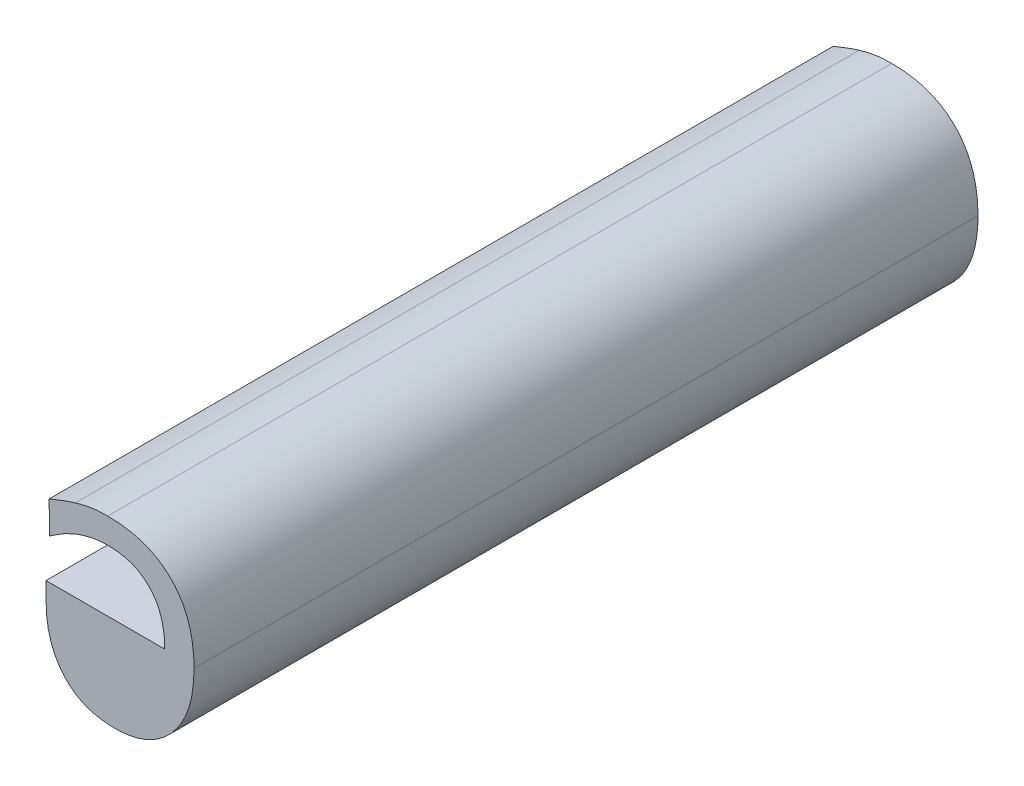
ISO-10303-21;
HEADER;
FILE_DESCRIPTION(('STEP AP214'),'2;1');
FILE_NAME('part.step','',(''),(''),'','','');
FILE_SCHEMA(('AUTOMOTIVE_DESIGN { 1 0 10303 214 1 1 1 1 }'));
ENDSEC;
DATA;
#1=APPLICATION_CONTEXT('core data for automotive mechanical design processes');
#2=APPLICATION_PROTOCOL_DEFINITION('international standard','automotive_design',2000,#1);
#3=PRODUCT_CONTEXT('',#1,'mechanical');
#4=PRODUCT('Part','Part','',(#3));
#5=PRODUCT_RELATED_PRODUCT_CATEGORY('part','',(#4));
#6=PRODUCT_DEFINITION_FORMATION('','',#4);
#7=PRODUCT_DEFINITION_CONTEXT('part definition',#1,'design');
#8=PRODUCT_DEFINITION('design','',#6,#7);
#9=PRODUCT_DEFINITION_SHAPE('','',#8);
#10=(LENGTH_UNIT() NAMED_UNIT(*) SI_UNIT(.MILLI.,.METRE.));
#11=(NAMED_UNIT(*) PLANE_ANGLE_UNIT() SI_UNIT($,.RADIAN.));
#12=(NAMED_UNIT(*) SI_UNIT($,.STERADIAN.) SOLID_ANGLE_UNIT());
#13=UNCERTAINTY_MEASURE_WITH_UNIT(LENGTH_MEASURE(1.E-05),#10,'distance_accuracy_value','');
#14=(GEOMETRIC_REPRESENTATION_CONTEXT(3) GLOBAL_UNCERTAINTY_ASSIGNED_CONTEXT((#13)) GLOBAL_UNIT_ASSIGNED_CONTEXT((#10,
#11,#12)) REPRESENTATION_CONTEXT('',''));
#15=CARTESIAN_POINT('',(0.,0.,0.));
#16=DIRECTION('',(0.,0.,1.));
#17=DIRECTION('',(1.,0.,0.));
#18=AXIS2_PLACEMENT_3D('',#15,#16,#17);
#19=CARTESIAN_POINT('',(5.08471298388066,3.56975577851379,0.));
#20=CARTESIAN_POINT('',(5.08471298388066,3.56975577851379,0.1));
#21=CARTESIAN_POINT('',(5.08486596612033,3.5698846056629,0.));
#22=CARTESIAN_POINT('',(5.08486596612033,3.5698846056629,0.1));
#23=CARTESIAN_POINT('',(5.08501894836,3.570013432812,0.));
#24=CARTESIAN_POINT('',(5.08501894836,3.570013432812,0.1));
#25=CARTESIAN_POINT('',(5.085467927339,3.570391520373,0.));
#26=CARTESIAN_POINT('',(5.085467927339,3.570391520373,0.1));
#27=CARTESIAN_POINT('',(5.086838494749,3.571218586914,0.));
#28=CARTESIAN_POINT('',(5.086838494749,3.571218586914,0.1));
#29=CARTESIAN_POINT('',(5.087830974598,3.571691196366,0.));
#30=CARTESIAN_POINT('',(5.087830974598,3.571691196366,0.1));
#31=B_SPLINE_SURFACE_WITH_KNOTS('',2,1,((#19,#20),(#21,#22),(#23,#24),(#25,#26),(#27,#28),(#29,
#30)),.UNSPECIFIED.,.F.,.F.,.F.,(3,2,1,3),(2,2),(-2.34073363525477,-2.,-1.,0.),(0.,0.01),.UNSPECIFIED.);
#32=CARTESIAN_POINT('',(5.08489451496393,3.56990864679433,0.1));
#33=CARTESIAN_POINT('',(5.08522839351065,3.57018056055757,0.1));
#34=CARTESIAN_POINT('',(5.08557407060745,3.5704337847817,0.1));
#35=CARTESIAN_POINT('',(5.0865314603025,3.57106191453689,0.1));
#36=CARTESIAN_POINT('',(5.08716460308373,3.57140287350332,0.1));
#37=CARTESIAN_POINT('',(5.087830974598,3.571691196366,0.1));
#38=B_SPLINE_CURVE_WITH_KNOTS('',3,(#32,#33,#34,#35,#36,#37),.UNSPECIFIED.,.F.,.F.,(4,2,4),(0.,
0.00128551019693775,0.00344284771894454),.UNSPECIFIED.);
#39=CARTESIAN_POINT('',(5.08485039453546,3.56996103980316,0.1));
#40=VERTEX_POINT('',#39);
#41=CARTESIAN_POINT('',(5.087830974598,3.571691196366,0.1));
#42=VERTEX_POINT('',#41);
#43=EDGE_CURVE('E296',#40,#42,#38,.T.);
#44=DIRECTION('',(0.,0.,1.));
#45=VECTOR('',#44,1.);
#46=CARTESIAN_POINT('',(5.084806274107,3.56983433870433,0.));
#47=LINE('',#46,#45);
#48=CARTESIAN_POINT('',(5.08485039453546,3.56996103980316,0.));
#49=VERTEX_POINT('',#48);
#50=EDGE_CURVE('E111',#49,#40,#47,.T.);
#51=CARTESIAN_POINT('',(5.08489451496393,3.56990864679433,0.));
#52=CARTESIAN_POINT('',(5.08522839351064,3.57018056055757,0.));
#53=CARTESIAN_POINT('',(5.08557407060744,3.5704337847817,0.));
#54=CARTESIAN_POINT('',(5.0865314603025,3.57106191453689,0.));
#55=CARTESIAN_POINT('',(5.08716460308373,3.57140287350332,0.));
#56=CARTESIAN_POINT('',(5.087830974598,3.571691196366,0.));
#57=B_SPLINE_CURVE_WITH_KNOTS('',3,(#51,#52,#53,#54,#55,#56),.UNSPECIFIED.,.F.,.F.,(4,2,4),(0.,
0.00128551019693724,0.00344284771894541),.UNSPECIFIED.);
#58=CARTESIAN_POINT('',(5.087830974598,3.571691196366,0.));
#59=VERTEX_POINT('',#58);
#60=EDGE_CURVE('E107',#49,#59,#57,.T.);
#61=DIRECTION('',(0.,0.,-1.));
#62=VECTOR('',#61,1.);
#63=CARTESIAN_POINT('',(5.087830974598,3.571691196366,0.05));
#64=LINE('',#63,#62);
#65=EDGE_CURVE('E372',#42,#59,#64,.T.);
#66=ORIENTED_EDGE('',*,*,#43,.F.);
#67=ORIENTED_EDGE('',*,*,#50,.F.);
#68=ORIENTED_EDGE('',*,*,#60,.T.);
#69=ORIENTED_EDGE('',*,*,#65,.F.);
#70=EDGE_LOOP('',(#66,#67,#68,#69));
#71=FACE_BOUND('',#70,.T.);
#72=ADVANCED_FACE('F17',(#71),#31,.T.);
#73=CARTESIAN_POINT('',(5.087830974598,3.571691196366,0.));
#74=CARTESIAN_POINT('',(5.087830974598,3.571691196366,0.1));
#75=CARTESIAN_POINT('',(5.088776193502,3.572116544872,0.));
#76=CARTESIAN_POINT('',(5.088776193502,3.572116544872,0.1));
#77=CARTESIAN_POINT('',(5.091115610288,3.572660045742,0.));
#78=CARTESIAN_POINT('',(5.091115610288,3.572660045742,0.1));
#79=CARTESIAN_POINT('',(5.092320764391,3.572660045742,0.));
#80=CARTESIAN_POINT('',(5.092320764391,3.572660045742,0.1));
#81=B_SPLINE_SURFACE_WITH_KNOTS('',2,1,((#73,#74),(#75,#76),(#77,#78),(#79,#80)),.UNSPECIFIED.,
.F.,.F.,.F.,(3,1,3),(2,2),(-2.,-1.,0.),(0.,0.01),.UNSPECIFIED.);
#82=CARTESIAN_POINT('',(5.087830974598,3.571691196366,0.1));
#83=CARTESIAN_POINT('',(5.08819893107785,3.57185295408656,0.1));
#84=CARTESIAN_POINT('',(5.08857518210044,3.57199570228706,0.1));
#85=CARTESIAN_POINT('',(5.08934037198487,3.57224171269096,0.1));
#86=CARTESIAN_POINT('',(5.08972931074638,3.57234497520651,0.1));
#87=CARTESIAN_POINT('',(5.09051597570848,3.57251054881514,0.1));
#88=CARTESIAN_POINT('',(5.09091370179518,3.57257286043865,0.1));
#89=CARTESIAN_POINT('',(5.09164822805203,3.57264475970098,0.1));
#90=CARTESIAN_POINT('',(5.09198436712421,3.57266129747142,0.1));
#91=CARTESIAN_POINT('',(5.092320764391,3.572660045742,0.1));
#92=B_SPLINE_CURVE_WITH_KNOTS('',3,(#82,#83,#84,#85,#86,#87,#88,#89,#90,#91),.UNSPECIFIED.,.F.,
.F.,(4,2,2,2,4),(0.,0.00120517771864309,0.00241034590958957,0.00361549848946786,
0.00462377659984421),.UNSPECIFIED.);
#93=CARTESIAN_POINT('',(5.092320764391,3.572660045742,0.1));
#94=VERTEX_POINT('',#93);
#95=EDGE_CURVE('E178',#42,#94,#92,.T.);
#96=CARTESIAN_POINT('',(5.087830974598,3.571691196366,0.));
#97=CARTESIAN_POINT('',(5.08819893107785,3.57185295408656,0.));
#98=CARTESIAN_POINT('',(5.08857518210044,3.57199570228706,0.));
#99=CARTESIAN_POINT('',(5.08934037198487,3.57224171269096,0.));
#100=CARTESIAN_POINT('',(5.08972931074638,3.57234497520651,0.));
#101=CARTESIAN_POINT('',(5.09051597570848,3.57251054881514,0.));
#102=CARTESIAN_POINT('',(5.09091370179518,3.57257286043865,0.));
#103=CARTESIAN_POINT('',(5.09164822805203,3.57264475970098,0.));
#104=CARTESIAN_POINT('',(5.09198436712421,3.57266129747142,0.));
#105=CARTESIAN_POINT('',(5.092320764391,3.572660045742,0.));
#106=B_SPLINE_CURVE_WITH_KNOTS('',3,(#96,#97,#98,#99,#100,#101,#102,#103,#104,#105),
.UNSPECIFIED.,.F.,.F.,(4,2,2,2,4),(0.,0.00120517771864309,0.00241034590958957,
0.00361549848946786,0.00462377659984421),.UNSPECIFIED.);
#107=CARTESIAN_POINT('',(5.092320764391,3.572660045742,0.));
#108=VERTEX_POINT('',#107);
#109=EDGE_CURVE('E100',#59,#108,#106,.T.);
#110=DIRECTION('',(0.,0.,-1.));
#111=VECTOR('',#110,1.);
#112=CARTESIAN_POINT('',(5.092320764391,3.572660045742,0.05));
#113=LINE('',#112,#111);
#114=EDGE_CURVE('E370',#94,#108,#113,.T.);
#115=ORIENTED_EDGE('',*,*,#95,.F.);
#116=ORIENTED_EDGE('',*,*,#65,.T.);
#117=ORIENTED_EDGE('',*,*,#109,.T.);
#118=ORIENTED_EDGE('',*,*,#114,.F.);
#119=EDGE_LOOP('',(#115,#116,#117,#118));
#120=FACE_BOUND('',#119,.T.);
#121=ADVANCED_FACE('F239',(#120),#81,.T.);
#122=CARTESIAN_POINT('',(5.092320764391,3.572660045742,0.));
#123=CARTESIAN_POINT('',(5.092320764391,3.572660045742,0.1));
#124=CARTESIAN_POINT('',(5.095723552444,3.572660045742,0.));
#125=CARTESIAN_POINT('',(5.095723552444,3.572660045742,0.1));
#126=CARTESIAN_POINT('',(5.099551689004,3.568619234929,0.));
#127=CARTESIAN_POINT('',(5.099551689004,3.568619234929,0.1));
#128=CARTESIAN_POINT('',(5.099551689004,3.564814728842,0.));
#129=CARTESIAN_POINT('',(5.099551689004,3.564814728842,0.1));
#130=B_SPLINE_SURFACE_WITH_KNOTS('',2,1,((#122,#123),(#124,#125),(#126,#127),(#128,#129)),
.UNSPECIFIED.,.F.,.F.,.F.,(3,1,3),(2,2),(-2.,-1.,0.),(0.,0.01),.UNSPECIFIED.);
#131=CARTESIAN_POINT('',(5.092320764391,3.572660045742,0.1));
#132=CARTESIAN_POINT('',(5.09333677026611,3.57266003196227,0.1));
#133=CARTESIAN_POINT('',(5.09437157495216,3.57252054021269,0.1));
#134=CARTESIAN_POINT('',(5.09564144647096,3.57204687193845,0.1));
#135=CARTESIAN_POINT('',(5.0959512502813,3.57190349900785,0.1));
#136=CARTESIAN_POINT('',(5.09711645956394,3.57123318234541,0.1));
#137=CARTESIAN_POINT('',(5.09787003489927,3.57050021974923,0.1));
#138=CARTESIAN_POINT('',(5.09857476787802,3.56936099893732,0.1));
#139=CARTESIAN_POINT('',(5.09872649541321,3.56906092723621,0.1));
#140=CARTESIAN_POINT('',(5.09903887371182,3.5683195824899,0.1));
#141=CARTESIAN_POINT('',(5.09917898106242,3.56786969683337,0.1));
#142=CARTESIAN_POINT('',(5.09947881877708,3.56655938441106,0.1));
#143=CARTESIAN_POINT('',(5.09955317939551,3.56567637519747,0.1));
#144=CARTESIAN_POINT('',(5.099551689004,3.564814728842,0.1));
#145=B_SPLINE_CURVE_WITH_KNOTS('',3,(#131,#132,#133,#134,#135,#136,#137,#138,#139,#140,#141,
#142,#143,#144),.UNSPECIFIED.,.F.,.F.,(4,2,2,2,2,2,4),(0.,0.00304176599878812,
0.00406354679694804,0.00705870429883773,0.00806527201181957,0.00947299870312214,
0.0120825731976572),.UNSPECIFIED.);
#146=CARTESIAN_POINT('',(5.099551689004,3.564814728842,0.1));
#147=VERTEX_POINT('',#146);
#148=EDGE_CURVE('E226',#94,#147,#145,.T.);
#149=CARTESIAN_POINT('',(5.092320764391,3.572660045742,0.));
#150=CARTESIAN_POINT('',(5.09333677026611,3.57266003196227,0.));
#151=CARTESIAN_POINT('',(5.09437157495216,3.57252054021269,0.));
#152=CARTESIAN_POINT('',(5.09564144647096,3.57204687193845,0.));
#153=CARTESIAN_POINT('',(5.0959512502813,3.57190349900785,0.));
#154=CARTESIAN_POINT('',(5.09711645956394,3.57123318234541,0.));
#155=CARTESIAN_POINT('',(5.09787003489927,3.57050021974923,0.));
#156=CARTESIAN_POINT('',(5.09857476787802,3.56936099893732,0.));
#157=CARTESIAN_POINT('',(5.09872649541321,3.56906092723621,0.));
#158=CARTESIAN_POINT('',(5.09903887371182,3.5683195824899,0.));
#159=CARTESIAN_POINT('',(5.09917898106242,3.56786969683337,0.));
#160=CARTESIAN_POINT('',(5.09947881877708,3.56655938441106,0.));
#161=CARTESIAN_POINT('',(5.09955317939551,3.56567637519747,0.));
#162=CARTESIAN_POINT('',(5.099551689004,3.564814728842,0.));
#163=B_SPLINE_CURVE_WITH_KNOTS('',3,(#149,#150,#151,#152,#153,#154,#155,#156,#157,#158,#159,
#160,#161,#162),.UNSPECIFIED.,.F.,.F.,(4,2,2,2,2,2,4),(0.,0.00304176599878812,
0.00406354679694804,0.00705870429883743,0.00806527201181849,0.00947299870312174,
0.0120825731976572),.UNSPECIFIED.);
#164=CARTESIAN_POINT('',(5.099551689004,3.564814728842,0.));
#165=VERTEX_POINT('',#164);
#166=EDGE_CURVE('E130',#108,#165,#163,.T.);
#167=DIRECTION('',(0.,0.,1.));
#168=VECTOR('',#167,1.);
#169=CARTESIAN_POINT('',(5.099551689004,3.564814728842,0.));
#170=LINE('',#169,#168);
#171=EDGE_CURVE('E125',#147,#165,#170,.F.);
#172=ORIENTED_EDGE('',*,*,#148,.F.);
#173=ORIENTED_EDGE('',*,*,#114,.T.);
#174=ORIENTED_EDGE('',*,*,#166,.T.);
#175=ORIENTED_EDGE('',*,*,#171,.F.);
#176=EDGE_LOOP('',(#172,#173,#174,#175));
#177=FACE_BOUND('',#176,.T.);
#178=ADVANCED_FACE('F234',(#177),#130,.T.);
#179=CARTESIAN_POINT('',(5.099551689004,3.564814728842,0.));
#180=DIRECTION('',(0.,1.,0.));
#181=DIRECTION('',(0.,0.,1.));
#182=AXIS2_PLACEMENT_3D('',#179,#180,#181);
#183=PLANE('',#182);
#184=DIRECTION('',(1.,0.,0.));
#185=VECTOR('',#184,1.);
#186=CARTESIAN_POINT('',(5.093380061972,3.564814728842,0.1));
#187=LINE('',#186,#185);
#188=CARTESIAN_POINT('',(5.084404556073,3.564814728842,0.1));
#189=VERTEX_POINT('',#188);
#190=EDGE_CURVE('E233',#147,#189,#187,.F.);
#191=ORIENTED_EDGE('',*,*,#190,.F.);
#192=ORIENTED_EDGE('',*,*,#171,.T.);
#193=DIRECTION('',(1.,0.,0.));
#194=VECTOR('',#193,1.);
#195=CARTESIAN_POINT('',(5.093380061972,3.564814728842,0.));
#196=LINE('',#195,#194);
#197=CARTESIAN_POINT('',(5.084404556073,3.564814728842,0.));
#198=VERTEX_POINT('',#197);
#199=EDGE_CURVE('E119',#165,#198,#196,.F.);
#200=ORIENTED_EDGE('',*,*,#199,.T.);
#201=DIRECTION('',(0.,0.,1.));
#202=VECTOR('',#201,1.);
#203=CARTESIAN_POINT('',(5.084404556073,3.564814728842,0.));
#204=LINE('',#203,#202);
#205=EDGE_CURVE('E123',#189,#198,#204,.F.);
#206=ORIENTED_EDGE('',*,*,#205,.F.);
#207=EDGE_LOOP('',(#191,#192,#200,#206));
#208=FACE_BOUND('',#207,.T.);
#209=ADVANCED_FACE('F122',(#208),#183,.T.);
#210=CARTESIAN_POINT('',(5.084404556073,3.564814728842,0.));
#211=DIRECTION('',(-1.,0.,0.));
#212=DIRECTION('',(0.,0.,1.));
#213=AXIS2_PLACEMENT_3D('',#210,#211,#212);
#214=PLANE('',#213);
#215=DIRECTION('',(0.,1.,0.));
#216=VECTOR('',#215,1.);
#217=CARTESIAN_POINT('',(5.084404556073,3.565780873701,0.1));
#218=LINE('',#217,#216);
#219=CARTESIAN_POINT('',(5.084404556073,3.562806138671,0.1));
#220=VERTEX_POINT('',#219);
#221=EDGE_CURVE('E136',#189,#220,#218,.F.);
#222=ORIENTED_EDGE('',*,*,#221,.F.);
#223=ORIENTED_EDGE('',*,*,#205,.T.);
#224=DIRECTION('',(0.,1.,0.));
#225=VECTOR('',#224,1.);
#226=CARTESIAN_POINT('',(5.084404556073,3.565780873701,0.));
#227=LINE('',#226,#225);
#228=CARTESIAN_POINT('',(5.084404556073,3.562806138671,0.));
#229=VERTEX_POINT('',#228);
#230=EDGE_CURVE('E129',#198,#229,#227,.F.);
#231=ORIENTED_EDGE('',*,*,#230,.T.);
#232=DIRECTION('',(0.,0.,-1.));
#233=VECTOR('',#232,1.);
#234=CARTESIAN_POINT('',(5.084404556073,3.562806138671,0.05));
#235=LINE('',#234,#233);
#236=EDGE_CURVE('E138',#220,#229,#235,.T.);
#237=ORIENTED_EDGE('',*,*,#236,.F.);
#238=EDGE_LOOP('',(#222,#223,#231,#237));
#239=FACE_BOUND('',#238,.T.);
#240=ADVANCED_FACE('F133',(#239),#214,.T.);
#241=CARTESIAN_POINT('',(5.084404556073,3.562806138671,0.));
#242=CARTESIAN_POINT('',(5.084404556073,3.562806138671,0.1));
#243=CARTESIAN_POINT('',(5.084404556073,3.560183156214,0.));
#244=CARTESIAN_POINT('',(5.084404556073,3.560183156214,0.1));
#245=CARTESIAN_POINT('',(5.08565697112,3.556567693907,0.));
#246=CARTESIAN_POINT('',(5.08565697112,3.556567693907,0.1));
#247=CARTESIAN_POINT('',(5.086838494749,3.55531527886,0.));
#248=CARTESIAN_POINT('',(5.086838494749,3.55531527886,0.1));
#249=B_SPLINE_SURFACE_WITH_KNOTS('',2,1,((#241,#242),(#243,#244),(#245,#246),(#247,#248)),
.UNSPECIFIED.,.F.,.F.,.F.,(3,1,3),(2,2),(-2.,-1.,0.),(0.,0.01),.UNSPECIFIED.);
#250=CARTESIAN_POINT('',(5.084404556073,3.562806138671,0.1));
#251=CARTESIAN_POINT('',(5.08440782671063,3.56216019826599,0.1));
#252=CARTESIAN_POINT('',(5.08443382637086,3.56150863092442,0.1));
#253=CARTESIAN_POINT('',(5.08457043019944,3.56021620022978,0.1));
#254=CARTESIAN_POINT('',(5.08468092443981,3.55957532407351,0.1));
#255=CARTESIAN_POINT('',(5.08502548180835,3.55832439924601,0.1));
#256=CARTESIAN_POINT('',(5.08525955419904,3.55771435288931,0.1));
#257=CARTESIAN_POINT('',(5.08589934800218,3.55647725538284,0.1));
#258=CARTESIAN_POINT('',(5.08632511380708,3.55586068342317,0.1));
#259=CARTESIAN_POINT('',(5.086838494749,3.55531527886,0.1));
#260=B_SPLINE_CURVE_WITH_KNOTS('',3,(#250,#251,#252,#253,#254,#255,#256,#257,#258,#259),
.UNSPECIFIED.,.F.,.F.,(4,2,2,2,4),(0.,0.00194659216948378,0.00389065611012321,
0.00583486578435001,0.00806242450381058),.UNSPECIFIED.);
#261=CARTESIAN_POINT('',(5.086838494749,3.55531527886,0.1));
#262=VERTEX_POINT('',#261);
#263=EDGE_CURVE('E220',#220,#262,#260,.T.);
#264=CARTESIAN_POINT('',(5.084404556073,3.562806138671,0.));
#265=CARTESIAN_POINT('',(5.08440782671063,3.56216019826599,0.));
#266=CARTESIAN_POINT('',(5.08443382637086,3.56150863092442,0.));
#267=CARTESIAN_POINT('',(5.08457043019944,3.56021620022978,0.));
#268=CARTESIAN_POINT('',(5.08468092443981,3.55957532407351,0.));
#269=CARTESIAN_POINT('',(5.08502548180835,3.55832439924601,0.));
#270=CARTESIAN_POINT('',(5.08525955419904,3.55771435288931,0.));
#271=CARTESIAN_POINT('',(5.08589934800218,3.55647725538284,0.));
#272=CARTESIAN_POINT('',(5.08632511380708,3.55586068342317,0.));
#273=CARTESIAN_POINT('',(5.086838494749,3.55531527886,0.));
#274=B_SPLINE_CURVE_WITH_KNOTS('',3,(#264,#265,#266,#267,#268,#269,#270,#271,#272,#273),
.UNSPECIFIED.,.F.,.F.,(4,2,2,2,4),(0.,0.00194659216948378,0.00389065611012321,
0.00583486578435001,0.00806242450381058),.UNSPECIFIED.);
#275=CARTESIAN_POINT('',(5.086838494749,3.55531527886,0.));
#276=VERTEX_POINT('',#275);
#277=EDGE_CURVE('E143',#229,#276,#274,.T.);
#278=DIRECTION('',(0.,0.,-1.));
#279=VECTOR('',#278,1.);
#280=CARTESIAN_POINT('',(5.086838494749,3.55531527886,0.05));
#281=LINE('',#280,#279);
#282=EDGE_CURVE('E272',#262,#276,#281,.T.);
#283=ORIENTED_EDGE('',*,*,#263,.F.);
#284=ORIENTED_EDGE('',*,*,#236,.T.);
#285=ORIENTED_EDGE('',*,*,#277,.T.);
#286=ORIENTED_EDGE('',*,*,#282,.F.);
#287=EDGE_LOOP('',(#283,#284,#285,#286));
#288=FACE_BOUND('',#287,.T.);
#289=ADVANCED_FACE('F245',(#288),#249,.T.);
#290=CARTESIAN_POINT('',(5.088138170742,3.575259397727,0.));
#291=CARTESIAN_POINT('',(5.088138170742,3.575259397727,0.1));
#292=CARTESIAN_POINT('',(5.087381995619,3.575046723474,0.));
#293=CARTESIAN_POINT('',(5.087381995619,3.575046723474,0.1));
#294=CARTESIAN_POINT('',(5.085444296867,3.574290548351,0.));
#295=CARTESIAN_POINT('',(5.085444296867,3.574290548351,0.1));
#296=CARTESIAN_POINT('',(5.084806274107,3.574030613152,0.));
#297=CARTESIAN_POINT('',(5.084806274107,3.574030613152,0.1));
#298=B_SPLINE_SURFACE_WITH_KNOTS('',2,1,((#290,#291),(#292,#293),(#294,#295),(#296,#297)),
.UNSPECIFIED.,.F.,.F.,.F.,(3,1,3),(2,2),(-2.,-1.,0.),(0.,0.01),.UNSPECIFIED.);
#299=CARTESIAN_POINT('',(5.088138170742,3.575259397727,0.1));
#300=CARTESIAN_POINT('',(5.08780395751231,3.57516546858989,0.1));
#301=CARTESIAN_POINT('',(5.08747435636681,3.57505805850545,0.1));
#302=CARTESIAN_POINT('',(5.08682095435063,3.57482660045065,0.1));
#303=CARTESIAN_POINT('',(5.08649715341202,3.57470255267528,0.1));
#304=CARTESIAN_POINT('',(5.08571769648054,3.57439521682394,0.1));
#305=CARTESIAN_POINT('',(5.08526323098899,3.5742087540753,0.1));
#306=CARTESIAN_POINT('',(5.08480627411218,3.57403061315411,0.1));
#307=B_SPLINE_CURVE_WITH_KNOTS('',3,(#299,#300,#301,#302,#303,#304,#305,#306),.UNSPECIFIED.,.F.,
.F.,(4,2,2,4),(0.,0.00104002750978482,0.00208004283217827,0.00355275373618372),.UNSPECIFIED.);
#308=CARTESIAN_POINT('',(5.088138170742,3.575259397727,0.1));
#309=VERTEX_POINT('',#308);
#310=CARTESIAN_POINT('',(5.084806274107,3.574030613152,0.1));
#311=VERTEX_POINT('',#310);
#312=EDGE_CURVE('E197',#309,#311,#307,.T.);
#313=DIRECTION('',(0.,0.,1.));
#314=VECTOR('',#313,1.);
#315=CARTESIAN_POINT('',(5.088138170742,3.575259397727,0.05));
#316=LINE('',#315,#314);
#317=CARTESIAN_POINT('',(5.088138170742,3.575259397727,0.));
#318=VERTEX_POINT('',#317);
#319=EDGE_CURVE('E304',#318,#309,#316,.T.);
#320=CARTESIAN_POINT('',(5.088138170742,3.575259397727,0.));
#321=CARTESIAN_POINT('',(5.08780395751231,3.57516546858989,0.));
#322=CARTESIAN_POINT('',(5.08747435636681,3.57505805850545,0.));
#323=CARTESIAN_POINT('',(5.08682095435063,3.57482660045065,0.));
#324=CARTESIAN_POINT('',(5.08649715341202,3.57470255267528,0.));
#325=CARTESIAN_POINT('',(5.08571769648054,3.57439521682394,0.));
#326=CARTESIAN_POINT('',(5.08526323098899,3.5742087540753,0.));
#327=CARTESIAN_POINT('',(5.08480627411218,3.57403061315411,0.));
#328=B_SPLINE_CURVE_WITH_KNOTS('',3,(#320,#321,#322,#323,#324,#325,#326,#327),.UNSPECIFIED.,.F.,
.F.,(4,2,2,4),(0.,0.00104002750978482,0.00208004283217827,0.00355275373618404),.UNSPECIFIED.);
#329=CARTESIAN_POINT('',(5.08480627410959,3.57403061315306,0.));
#330=VERTEX_POINT('',#329);
#331=EDGE_CURVE('E306',#318,#330,#328,.T.);
#332=DIRECTION('',(0.,0.,1.));
#333=VECTOR('',#332,1.);
#334=CARTESIAN_POINT('',(5.084806274107,3.574030613152,0.));
#335=LINE('',#334,#333);
#336=EDGE_CURVE('E357',#311,#330,#335,.F.);
#337=ORIENTED_EDGE('',*,*,#312,.F.);
#338=ORIENTED_EDGE('',*,*,#319,.F.);
#339=ORIENTED_EDGE('',*,*,#331,.T.);
#340=ORIENTED_EDGE('',*,*,#336,.F.);
#341=EDGE_LOOP('',(#337,#338,#339,#340));
#342=FACE_BOUND('',#341,.T.);
#343=ADVANCED_FACE('F398',(#342),#298,.T.);
#344=CARTESIAN_POINT('',(5.084806274107,3.574030613152,0.));
#345=DIRECTION('',(-1.,0.,0.));
#346=DIRECTION('',(0.,0.,1.));
#347=AXIS2_PLACEMENT_3D('',#344,#345,#346);
#348=PLANE('',#347);
#349=DIRECTION('',(0.,1.,0.));
#350=VECTOR('',#349,1.);
#351=CARTESIAN_POINT('',(5.084806274107,3.565780873701,0.1));
#352=LINE('',#351,#350);
#353=EDGE_CURVE('E343',#311,#40,#352,.F.);
#354=ORIENTED_EDGE('',*,*,#353,.F.);
#355=ORIENTED_EDGE('',*,*,#336,.T.);
#356=DIRECTION('',(0.,1.,0.));
#357=VECTOR('',#356,1.);
#358=CARTESIAN_POINT('',(5.084806274107,3.565780873701,0.));
#359=LINE('',#358,#357);
#360=EDGE_CURVE('E305',#330,#49,#359,.F.);
#361=ORIENTED_EDGE('',*,*,#360,.T.);
#362=ORIENTED_EDGE('',*,*,#50,.T.);
#363=EDGE_LOOP('',(#354,#355,#361,#362));
#364=FACE_BOUND('',#363,.T.);
#365=ADVANCED_FACE('F429',(#364),#348,.T.);
#366=CARTESIAN_POINT('',(5.086838494749,3.55531527886,0.));
#367=CARTESIAN_POINT('',(5.086838494749,3.55531527886,0.1));
#368=CARTESIAN_POINT('',(5.087996387906,3.554062863812,0.));
#369=CARTESIAN_POINT('',(5.087996387906,3.554062863812,0.1));
#370=CARTESIAN_POINT('',(5.091139240761,3.552881340183,0.));
#371=CARTESIAN_POINT('',(5.091139240761,3.552881340183,0.1));
#372=CARTESIAN_POINT('',(5.093171461404,3.552881340183,0.));
#373=CARTESIAN_POINT('',(5.093171461404,3.552881340183,0.1));
#374=B_SPLINE_SURFACE_WITH_KNOTS('',2,1,((#366,#367),(#368,#369),(#370,#371),(#372,#373)),
.UNSPECIFIED.,.F.,.F.,.F.,(3,1,3),(2,2),(-2.,-1.,0.),(0.,0.01),.UNSPECIFIED.);
#375=CARTESIAN_POINT('',(5.086838494749,3.55531527886,0.1));
#376=CARTESIAN_POINT('',(5.0872279679596,3.55488169923689,0.1));
#377=CARTESIAN_POINT('',(5.08767506589054,3.55450459387426,0.1));
#378=CARTESIAN_POINT('',(5.08864784836424,3.55386959926573,0.1));
#379=CARTESIAN_POINT('',(5.08917353696851,3.55361171618399,0.1));
#380=CARTESIAN_POINT('',(5.09026681479705,3.55322147104841,0.1));
#381=CARTESIAN_POINT('',(5.09083440591305,3.55308911466535,0.1));
#382=CARTESIAN_POINT('',(5.09199374281757,3.55291920659467,0.1));
#383=CARTESIAN_POINT('',(5.09258572830093,3.55288318181067,0.1));
#384=CARTESIAN_POINT('',(5.093171461404,3.552881340183,0.1));
#385=B_SPLINE_CURVE_WITH_KNOTS('',3,(#375,#376,#377,#378,#379,#380,#381,#382,#383,#384),
.UNSPECIFIED.,.F.,.F.,(4,2,2,2,4),(0.,0.00173866988011109,0.00347742964463939,
0.00521626795543881,0.00698250872872584),.UNSPECIFIED.);
#386=CARTESIAN_POINT('',(5.093171461404,3.552881340183,0.1));
#387=VERTEX_POINT('',#386);
#388=EDGE_CURVE('E213',#262,#387,#385,.T.);
#389=CARTESIAN_POINT('',(5.086838494749,3.55531527886,0.));
#390=CARTESIAN_POINT('',(5.0872279679596,3.55488169923689,0.));
#391=CARTESIAN_POINT('',(5.08767506589054,3.55450459387426,0.));
#392=CARTESIAN_POINT('',(5.08864784836424,3.55386959926573,0.));
#393=CARTESIAN_POINT('',(5.08917353696851,3.55361171618399,0.));
#394=CARTESIAN_POINT('',(5.09026681479705,3.55322147104841,0.));
#395=CARTESIAN_POINT('',(5.09083440591305,3.55308911466535,0.));
#396=CARTESIAN_POINT('',(5.09199374281757,3.55291920659467,0.));
#397=CARTESIAN_POINT('',(5.09258572830093,3.55288318181067,0.));
#398=CARTESIAN_POINT('',(5.093171461404,3.552881340183,0.));
#399=B_SPLINE_CURVE_WITH_KNOTS('',3,(#389,#390,#391,#392,#393,#394,#395,#396,#397,#398),
.UNSPECIFIED.,.F.,.F.,(4,2,2,2,4),(0.,0.00173866988011109,0.00347742964463939,
0.00521626795543881,0.00698250872872584),.UNSPECIFIED.);
#400=CARTESIAN_POINT('',(5.093171461404,3.552881340183,0.));
#401=VERTEX_POINT('',#400);
#402=EDGE_CURVE('E145',#276,#401,#399,.T.);
#403=DIRECTION('',(0.,0.,-1.));
#404=VECTOR('',#403,1.);
#405=CARTESIAN_POINT('',(5.093171461404,3.552881340183,0.05));
#406=LINE('',#405,#404);
#407=EDGE_CURVE('E346',#387,#401,#406,.T.);
#408=ORIENTED_EDGE('',*,*,#388,.F.);
#409=ORIENTED_EDGE('',*,*,#282,.T.);
#410=ORIENTED_EDGE('',*,*,#402,.T.);
#411=ORIENTED_EDGE('',*,*,#407,.F.);
#412=EDGE_LOOP('',(#408,#409,#410,#411));
#413=FACE_BOUND('',#412,.T.);
#414=ADVANCED_FACE('F316',(#413),#374,.T.);
#415=CARTESIAN_POINT('',(5.093380061972,3.565780873701,0.));
#416=DIRECTION('',(0.,0.,1.));
#417=DIRECTION('',(1.,0.,0.));
#418=AXIS2_PLACEMENT_3D('',#415,#416,#417);
#419=PLANE('',#418);
#420=ORIENTED_EDGE('',*,*,#331,.F.);
#421=CARTESIAN_POINT('',(5.092273503445,3.575873790014,0.));
#422=CARTESIAN_POINT('',(5.0918316913532,3.57588449037934,0.));
#423=CARTESIAN_POINT('',(5.09139028551287,3.57586777255747,0.));
#424=CARTESIAN_POINT('',(5.09051181243792,3.5757864670869,0.));
#425=CARTESIAN_POINT('',(5.09007474492249,3.57572188255732,0.));
#426=CARTESIAN_POINT('',(5.08913415083127,3.57553723045897,0.));
#427=CARTESIAN_POINT('',(5.08863207734882,3.57540954885003,0.));
#428=CARTESIAN_POINT('',(5.088138170742,3.575259397727,0.));
#429=B_SPLINE_CURVE_WITH_KNOTS('',3,(#421,#422,#423,#424,#425,#426,#427,#428),.UNSPECIFIED.,.F.,
.F.,(4,2,2,4),(0.,0.0013232920704663,0.00264649791930771,0.00419656510782109),.UNSPECIFIED.);
#430=CARTESIAN_POINT('',(5.092273503445,3.575873790014,0.));
#431=VERTEX_POINT('',#430);
#432=EDGE_CURVE('E297',#431,#318,#429,.T.);
#433=ORIENTED_EDGE('',*,*,#432,.F.);
#434=CARTESIAN_POINT('',(5.103285303673,3.564554793643,0.));
#435=CARTESIAN_POINT('',(5.10329157733441,3.56606215669039,0.));
#436=CARTESIAN_POINT('',(5.10311847124673,3.56761662408719,0.));
#437=CARTESIAN_POINT('',(5.10250379678421,3.56957387606188,0.));
#438=CARTESIAN_POINT('',(5.10231167034997,3.57006529800331,0.));
#439=CARTESIAN_POINT('',(5.10185518020169,3.57100263491023,0.));
#440=CARTESIAN_POINT('',(5.1015922699191,3.57144924099494,0.));
#441=CARTESIAN_POINT('',(5.10070998021561,3.57268459935546,0.));
#442=CARTESIAN_POINT('',(5.09998680437632,3.57340406933794,0.));
#443=CARTESIAN_POINT('',(5.09876537112432,3.57426553786976,0.));
#444=CARTESIAN_POINT('',(5.09833834300534,3.57451556268271,0.));
#445=CARTESIAN_POINT('',(5.09734814184174,3.57499640934318,0.));
#446=CARTESIAN_POINT('',(5.09677639819561,3.57520925206331,0.));
#447=CARTESIAN_POINT('',(5.0949194176553,3.57573679511463,0.));
#448=CARTESIAN_POINT('',(5.09357936000601,3.57588102040008,0.));
#449=CARTESIAN_POINT('',(5.092273503445,3.575873790014,0.));
#450=B_SPLINE_CURVE_WITH_KNOTS('',3,(#434,#435,#436,#437,#438,#439,#440,#441,#442,#443,#444,
#445,#446,#447,#448,#449),.UNSPECIFIED.,.F.,.F.,(4,2,2,2,2,2,2,4),(0.,0.00455840466610234,
0.00613720305521575,0.00768577478515066,0.0106783407572528,0.0121573830705305,0.013980292175966,
0.0179281098065784),.UNSPECIFIED.);
#451=CARTESIAN_POINT('',(5.103285303673,3.564554793643,0.));
#452=VERTEX_POINT('',#451);
#453=EDGE_CURVE('E161',#452,#431,#450,.T.);
#454=ORIENTED_EDGE('',*,*,#453,.F.);
#455=CARTESIAN_POINT('',(5.093171461404,3.552881340183,0.));
#456=CARTESIAN_POINT('',(5.094308659692,3.55286785045382,0.));
#457=CARTESIAN_POINT('',(5.09545466409196,3.55303470733781,0.));
#458=CARTESIAN_POINT('',(5.09706611816265,3.55357501220664,0.));
#459=CARTESIAN_POINT('',(5.0975836798902,3.55380212461866,0.));
#460=CARTESIAN_POINT('',(5.09894953027118,3.55457179753512,0.));
#461=CARTESIAN_POINT('',(5.09973999272991,3.55522215763906,0.));
#462=CARTESIAN_POINT('',(5.10076057762979,3.55635189090926,0.));
#463=CARTESIAN_POINT('',(5.10107637368966,3.55676086761688,0.));
#464=CARTESIAN_POINT('',(5.10164228239589,3.55762305274571,0.));
#465=CARTESIAN_POINT('',(5.10189240235375,3.5580762562356,0.));
#466=CARTESIAN_POINT('',(5.10239467504017,3.55916404059261,0.));
#467=CARTESIAN_POINT('',(5.10262138828814,3.55980992317771,0.));
#468=CARTESIAN_POINT('',(5.10314806568339,3.56180044500848,0.));
#469=CARTESIAN_POINT('',(5.10329053661639,3.56319163842848,0.));
#470=CARTESIAN_POINT('',(5.103285303673,3.564554793643,0.));
#471=B_SPLINE_CURVE_WITH_KNOTS('',3,(#455,#456,#457,#458,#459,#460,#461,#462,#463,#464,#465,
#466,#467,#468,#469,#470),.UNSPECIFIED.,.F.,.F.,(4,2,2,2,2,2,2,4),(0.,0.00339920105595817,
0.00508675294601325,0.00809380554314352,0.00964018948397242,0.0111864011982899,
0.0132320518993801,0.0173449071736234),.UNSPECIFIED.);
#472=EDGE_CURVE('E337',#401,#452,#471,.T.);
#473=ORIENTED_EDGE('',*,*,#472,.F.);
#474=ORIENTED_EDGE('',*,*,#402,.F.);
#475=ORIENTED_EDGE('',*,*,#277,.F.);
#476=ORIENTED_EDGE('',*,*,#230,.F.);
#477=ORIENTED_EDGE('',*,*,#199,.F.);
#478=ORIENTED_EDGE('',*,*,#166,.F.);
#479=ORIENTED_EDGE('',*,*,#109,.F.);
#480=ORIENTED_EDGE('',*,*,#60,.F.);
#481=ORIENTED_EDGE('',*,*,#360,.F.);
#482=EDGE_LOOP('',(#420,#433,#454,#473,#474,#475,#476,#477,#478,#479,#480,#481));
#483=FACE_BOUND('',#482,.T.);
#484=ADVANCED_FACE('F141',(#483),#419,.F.);
#485=CARTESIAN_POINT('',(5.092273503445,3.575873790014,0.));
#486=CARTESIAN_POINT('',(5.092273503445,3.575873790014,0.1));
#487=CARTESIAN_POINT('',(5.09095019698,3.575873790014,0.));
#488=CARTESIAN_POINT('',(5.09095019698,3.575873790014,0.1));
#489=CARTESIAN_POINT('',(5.089201542009,3.575566593871,0.));
#490=CARTESIAN_POINT('',(5.089201542009,3.575566593871,0.1));
#491=CARTESIAN_POINT('',(5.088138170742,3.575259397727,0.));
#492=CARTESIAN_POINT('',(5.088138170742,3.575259397727,0.1));
#493=B_SPLINE_SURFACE_WITH_KNOTS('',2,1,((#485,#486),(#487,#488),(#489,#490),(#491,#492)),
.UNSPECIFIED.,.F.,.F.,.F.,(3,1,3),(2,2),(-2.,-1.,0.),(0.,0.01),.UNSPECIFIED.);
#494=CARTESIAN_POINT('',(5.092273503445,3.575873790014,0.1));
#495=CARTESIAN_POINT('',(5.0918316913532,3.57588449037934,0.1));
#496=CARTESIAN_POINT('',(5.09139028551287,3.57586777255747,0.1));
#497=CARTESIAN_POINT('',(5.09051181243792,3.5757864670869,0.1));
#498=CARTESIAN_POINT('',(5.09007474492249,3.57572188255732,0.1));
#499=CARTESIAN_POINT('',(5.08913415083127,3.57553723045897,0.1));
#500=CARTESIAN_POINT('',(5.08863207734882,3.57540954885003,0.1));
#501=CARTESIAN_POINT('',(5.088138170742,3.575259397727,0.1));
#502=B_SPLINE_CURVE_WITH_KNOTS('',3,(#494,#495,#496,#497,#498,#499,#500,#501),.UNSPECIFIED.,.F.,
.F.,(4,2,2,4),(0.,0.0013232920704663,0.00264649791930771,0.00419656510782109),.UNSPECIFIED.);
#503=CARTESIAN_POINT('',(5.092273503445,3.575873790014,0.1));
#504=VERTEX_POINT('',#503);
#505=EDGE_CURVE('E205',#504,#309,#502,.T.);
#506=DIRECTION('',(0.,0.,1.));
#507=VECTOR('',#506,1.);
#508=CARTESIAN_POINT('',(5.092273503445,3.575873790014,0.05));
#509=LINE('',#508,#507);
#510=EDGE_CURVE('E160',#431,#504,#509,.T.);
#511=ORIENTED_EDGE('',*,*,#505,.F.);
#512=ORIENTED_EDGE('',*,*,#510,.F.);
#513=ORIENTED_EDGE('',*,*,#432,.T.);
#514=ORIENTED_EDGE('',*,*,#319,.T.);
#515=EDGE_LOOP('',(#511,#512,#513,#514));
#516=FACE_BOUND('',#515,.T.);
#517=ADVANCED_FACE('F172',(#516),#493,.T.);
#518=CARTESIAN_POINT('',(5.093380061972,3.565780873701,0.1));
#519=DIRECTION('',(0.,0.,1.));
#520=DIRECTION('',(1.,0.,0.));
#521=AXIS2_PLACEMENT_3D('',#518,#519,#520);
#522=PLANE('',#521);
#523=ORIENTED_EDGE('',*,*,#312,.T.);
#524=ORIENTED_EDGE('',*,*,#353,.T.);
#525=ORIENTED_EDGE('',*,*,#43,.T.);
#526=ORIENTED_EDGE('',*,*,#95,.T.);
#527=ORIENTED_EDGE('',*,*,#148,.T.);
#528=ORIENTED_EDGE('',*,*,#190,.T.);
#529=ORIENTED_EDGE('',*,*,#221,.T.);
#530=ORIENTED_EDGE('',*,*,#263,.T.);
#531=ORIENTED_EDGE('',*,*,#388,.T.);
#532=CARTESIAN_POINT('',(5.103285303673,3.564554793643,0.1));
#533=CARTESIAN_POINT('',(5.10329074122659,3.56307265669835,0.0999999999999999));
#534=CARTESIAN_POINT('',(5.103122180492,3.56155865680803,0.1));
#535=CARTESIAN_POINT('',(5.1025336245279,3.55956139573006,0.1));
#536=CARTESIAN_POINT('',(5.10232724306492,3.55900834508369,0.1));
#537=CARTESIAN_POINT('',(5.10183196094125,3.55795603111145,0.1));
#538=CARTESIAN_POINT('',(5.10154532508627,3.55745574862975,0.1));
#539=CARTESIAN_POINT('',(5.10089979215124,3.55652229535271,0.1));
#540=CARTESIAN_POINT('',(5.10054265254059,3.55608787490809,0.1));
#541=CARTESIAN_POINT('',(5.09940877165113,3.55492888697734,0.1));
#542=CARTESIAN_POINT('',(5.09853973340653,3.55428627492581,0.1));
#543=CARTESIAN_POINT('',(5.09713299870601,3.55360395956934,0.1));
#544=CARTESIAN_POINT('',(5.09665855985128,3.55342457137577,0.1));
#545=CARTESIAN_POINT('',(5.09520105377506,3.55300299135842,0.1));
#546=CARTESIAN_POINT('',(5.09418241345712,3.55287645254786,0.1));
#547=CARTESIAN_POINT('',(5.093171461404,3.552881340183,0.1));
#548=B_SPLINE_CURVE_WITH_KNOTS('',3,(#532,#533,#534,#535,#536,#537,#538,#539,#540,#541,#542,
#543,#544,#545,#546,#547),.UNSPECIFIED.,.F.,.F.,(4,2,2,2,2,2,2,4),(0.,0.00446587826983797,
0.00623187699860335,0.00795234263202199,0.00963437102678909,0.0127996624210117,
0.0143158697277333,0.0173435030639232),.UNSPECIFIED.);
#549=CARTESIAN_POINT('',(5.103285303673,3.564554793643,0.1));
#550=VERTEX_POINT('',#549);
#551=EDGE_CURVE('E39',#550,#387,#548,.T.);
#552=ORIENTED_EDGE('',*,*,#551,.F.);
#553=CARTESIAN_POINT('',(5.092273503445,3.575873790014,0.1));
#554=CARTESIAN_POINT('',(5.09378629860852,3.57588708536289,0.1));
#555=CARTESIAN_POINT('',(5.09534649458412,3.57568841664731,0.1));
#556=CARTESIAN_POINT('',(5.09727502970961,3.57501904949187,0.1));
#557=CARTESIAN_POINT('',(5.09774763206127,3.57481611112012,0.1));
#558=CARTESIAN_POINT('',(5.09864267870917,3.57434056898238,0.1));
#559=CARTESIAN_POINT('',(5.09906605345394,3.57406975082694,0.1));
#560=CARTESIAN_POINT('',(5.1002575601326,3.57315388889262,0.1));
#561=CARTESIAN_POINT('',(5.1009502125701,3.572404396246,0.1));
#562=CARTESIAN_POINT('',(5.10176984435849,3.57115296417197,0.1));
#563=CARTESIAN_POINT('',(5.10200583012288,3.57071720604147,0.1));
#564=CARTESIAN_POINT('',(5.10247590536002,3.56967276177732,0.1));
#565=CARTESIAN_POINT('',(5.10268540264983,3.56905323627316,0.1));
#566=CARTESIAN_POINT('',(5.10316465249064,3.56715799121406,0.1));
#567=CARTESIAN_POINT('',(5.10328854942865,3.56584012623124,0.1));
#568=CARTESIAN_POINT('',(5.103285303673,3.564554793643,0.1));
#569=B_SPLINE_CURVE_WITH_KNOTS('',3,(#553,#554,#555,#556,#557,#558,#559,#560,#561,#562,#563,
#564,#565,#566,#567,#568),.UNSPECIFIED.,.F.,.F.,(4,2,2,2,2,2,2,4),(0.,0.00456740049650077,
0.00610596834656631,0.00760767357381248,0.0106016465321655,0.0120833322610613,
0.0140374144097268,0.0179270298028871),.UNSPECIFIED.);
#570=EDGE_CURVE('E30',#504,#550,#569,.T.);
#571=ORIENTED_EDGE('',*,*,#570,.F.);
#572=ORIENTED_EDGE('',*,*,#505,.T.);
#573=EDGE_LOOP('',(#523,#524,#525,#526,#527,#528,#529,#530,#531,#552,#571,#572));
#574=FACE_BOUND('',#573,.T.);
#575=ADVANCED_FACE('F168',(#574),#522,.T.);
#576=CARTESIAN_POINT('',(5.093171461404,3.552881340183,0.));
#577=CARTESIAN_POINT('',(5.093171461404,3.552881340183,0.1));
#578=CARTESIAN_POINT('',(5.097684881669,3.552881340183,0.));
#579=CARTESIAN_POINT('',(5.097684881669,3.552881340183,0.1));
#580=CARTESIAN_POINT('',(5.103285303673,3.559214306837,0.));
#581=CARTESIAN_POINT('',(5.103285303673,3.559214306837,0.1));
#582=CARTESIAN_POINT('',(5.103285303673,3.564554793643,0.));
#583=CARTESIAN_POINT('',(5.103285303673,3.564554793643,0.1));
#584=B_SPLINE_SURFACE_WITH_KNOTS('',2,1,((#576,#577),(#578,#579),(#580,#581),(#582,#583)),
.UNSPECIFIED.,.F.,.F.,.F.,(3,1,3),(2,2),(-2.,-1.,0.),(0.,0.01),.UNSPECIFIED.);
#585=DIRECTION('',(0.,0.,-1.));
#586=VECTOR('',#585,1.);
#587=CARTESIAN_POINT('',(5.103285303673,3.564554793643,0.05));
#588=LINE('',#587,#586);
#589=EDGE_CURVE('E11',#550,#452,#588,.T.);
#590=ORIENTED_EDGE('',*,*,#551,.T.);
#591=ORIENTED_EDGE('',*,*,#407,.T.);
#592=ORIENTED_EDGE('',*,*,#472,.T.);
#593=ORIENTED_EDGE('',*,*,#589,.F.);
#594=EDGE_LOOP('',(#590,#591,#592,#593));
#595=FACE_BOUND('',#594,.T.);
#596=ADVANCED_FACE('F171',(#595),#584,.T.);
#597=CARTESIAN_POINT('',(5.103285303673,3.564554793643,0.));
#598=CARTESIAN_POINT('',(5.103285303673,3.564554793643,0.1));
#599=CARTESIAN_POINT('',(5.103285303673,3.569989802339,0.));
#600=CARTESIAN_POINT('',(5.103285303673,3.569989802339,0.1));
#601=CARTESIAN_POINT('',(5.097519468361,3.575873790014,0.));
#602=CARTESIAN_POINT('',(5.097519468361,3.575873790014,0.1));
#603=CARTESIAN_POINT('',(5.092273503445,3.575873790014,0.));
#604=CARTESIAN_POINT('',(5.092273503445,3.575873790014,0.1));
#605=B_SPLINE_SURFACE_WITH_KNOTS('',2,1,((#597,#598),(#599,#600),(#601,#602),(#603,#604)),
.UNSPECIFIED.,.F.,.F.,.F.,(3,1,3),(2,2),(-2.,-1.,0.),(0.,0.01),.UNSPECIFIED.);
#606=ORIENTED_EDGE('',*,*,#570,.T.);
#607=ORIENTED_EDGE('',*,*,#589,.T.);
#608=ORIENTED_EDGE('',*,*,#453,.T.);
#609=ORIENTED_EDGE('',*,*,#510,.T.);
#610=EDGE_LOOP('',(#606,#607,#608,#609));
#611=FACE_BOUND('',#610,.T.);
#612=ADVANCED_FACE('F19',(#611),#605,.T.);
#613=CLOSED_SHELL('',(#72,#121,#178,#209,#240,#289,#343,#365,#414,#484,#517,#575,#596,#612));
#614=MANIFOLD_SOLID_BREP('B1',#613);
#615=ADVANCED_BREP_SHAPE_REPRESENTATION('',(#18,#614),#14);
#616=SHAPE_DEFINITION_REPRESENTATION(#9,#615);
ENDSEC;
END-ISO-10303-21;
